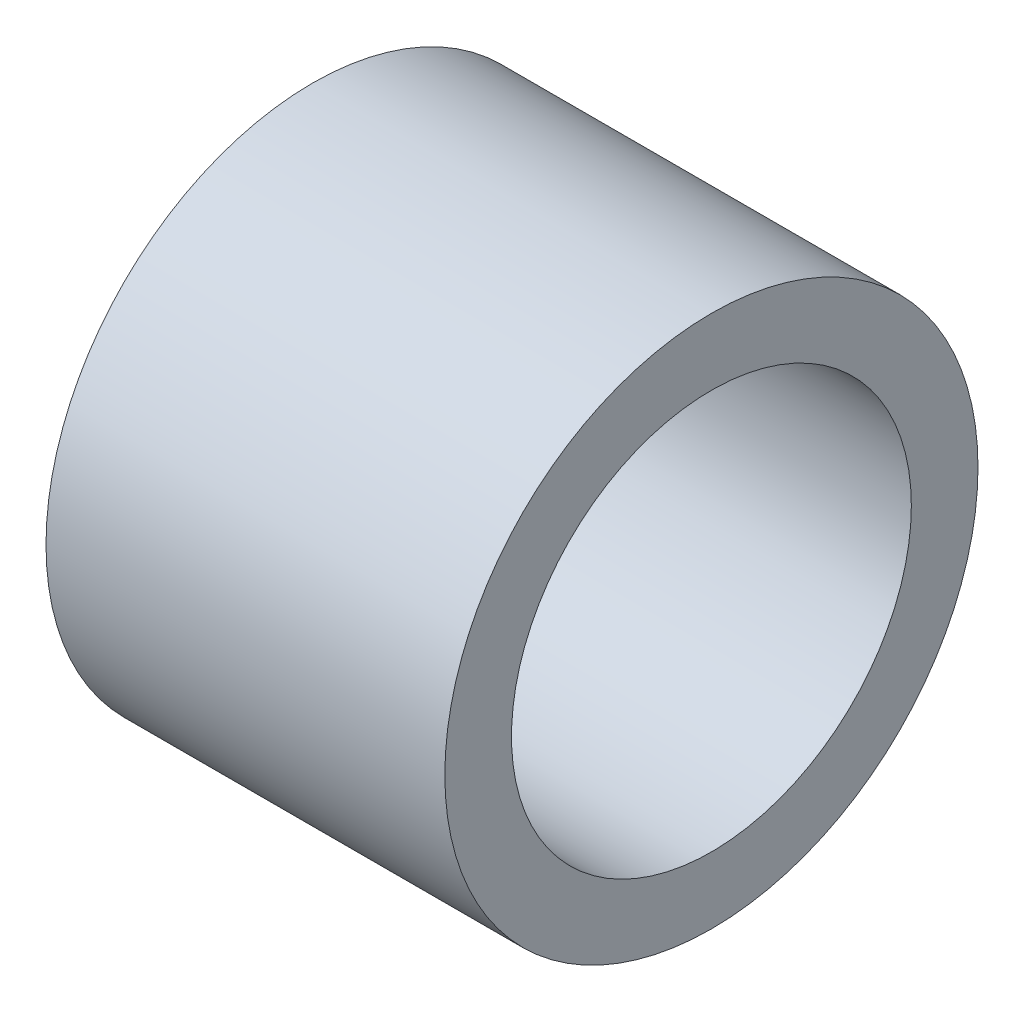
ISO-10303-21;
HEADER;
FILE_DESCRIPTION(('STEP AP214'),'2;1');
FILE_NAME('part.step','',(''),(''),'','','');
FILE_SCHEMA(('AUTOMOTIVE_DESIGN { 1 0 10303 214 1 1 1 1 }'));
ENDSEC;
DATA;
#1=APPLICATION_CONTEXT('core data for automotive mechanical design processes');
#2=APPLICATION_PROTOCOL_DEFINITION('international standard','automotive_design',2000,#1);
#3=PRODUCT_CONTEXT('',#1,'mechanical');
#4=PRODUCT('Part','Part','',(#3));
#5=PRODUCT_RELATED_PRODUCT_CATEGORY('part','',(#4));
#6=PRODUCT_DEFINITION_FORMATION('','',#4);
#7=PRODUCT_DEFINITION_CONTEXT('part definition',#1,'design');
#8=PRODUCT_DEFINITION('design','',#6,#7);
#9=PRODUCT_DEFINITION_SHAPE('','',#8);
#10=(LENGTH_UNIT() NAMED_UNIT(*) SI_UNIT(.MILLI.,.METRE.));
#11=(NAMED_UNIT(*) PLANE_ANGLE_UNIT() SI_UNIT($,.RADIAN.));
#12=(NAMED_UNIT(*) SI_UNIT($,.STERADIAN.) SOLID_ANGLE_UNIT());
#13=UNCERTAINTY_MEASURE_WITH_UNIT(LENGTH_MEASURE(1.E-05),#10,'distance_accuracy_value','');
#14=(GEOMETRIC_REPRESENTATION_CONTEXT(3) GLOBAL_UNCERTAINTY_ASSIGNED_CONTEXT((#13)) GLOBAL_UNIT_ASSIGNED_CONTEXT((#10,
#11,#12)) REPRESENTATION_CONTEXT('',''));
#15=CARTESIAN_POINT('',(0.,0.,0.));
#16=DIRECTION('',(0.,0.,1.));
#17=DIRECTION('',(1.,0.,0.));
#18=AXIS2_PLACEMENT_3D('',#15,#16,#17);
#19=CARTESIAN_POINT('',(9.5,0.,0.));
#20=DIRECTION('',(1.,0.,0.));
#21=DIRECTION('',(0.,0.,-1.));
#22=AXIS2_PLACEMENT_3D('',#19,#20,#21);
#23=PLANE('',#22);
#24=CARTESIAN_POINT('',(9.5,0.,0.));
#25=DIRECTION('',(1.,0.,0.));
#26=DIRECTION('',(0.,0.,-1.));
#27=AXIS2_PLACEMENT_3D('',#24,#25,#26);
#28=CIRCLE('',#27,12.7);
#29=CARTESIAN_POINT('',(9.5,0.,-12.7));
#30=VERTEX_POINT('',#29);
#31=EDGE_CURVE('E10',#30,#30,#28,.T.);
#32=ORIENTED_EDGE('',*,*,#31,.T.);
#33=EDGE_LOOP('',(#32));
#34=FACE_BOUND('',#33,.T.);
#35=CARTESIAN_POINT('',(9.5,0.,0.));
#36=DIRECTION('',(1.,0.,0.));
#37=DIRECTION('',(0.,0.,-1.));
#38=AXIS2_PLACEMENT_3D('',#35,#36,#37);
#39=CIRCLE('',#38,9.525);
#40=CARTESIAN_POINT('',(9.5,0.,-9.525));
#41=VERTEX_POINT('',#40);
#42=EDGE_CURVE('E54',#41,#41,#39,.T.);
#43=ORIENTED_EDGE('',*,*,#42,.F.);
#44=EDGE_LOOP('',(#43));
#45=FACE_BOUND('',#44,.T.);
#46=ADVANCED_FACE('F41',(#34,#45),#23,.T.);
#47=CARTESIAN_POINT('',(-9.5,0.,0.));
#48=DIRECTION('',(1.,0.,0.));
#49=DIRECTION('',(0.,0.,-1.));
#50=AXIS2_PLACEMENT_3D('',#47,#48,#49);
#51=PLANE('',#50);
#52=CARTESIAN_POINT('',(-9.5,0.,0.));
#53=DIRECTION('',(1.,0.,0.));
#54=DIRECTION('',(0.,0.,-1.));
#55=AXIS2_PLACEMENT_3D('',#52,#53,#54);
#56=CIRCLE('',#55,12.7);
#57=CARTESIAN_POINT('',(-9.5,0.,-12.7));
#58=VERTEX_POINT('',#57);
#59=EDGE_CURVE('E45',#58,#58,#56,.T.);
#60=ORIENTED_EDGE('',*,*,#59,.F.);
#61=EDGE_LOOP('',(#60));
#62=FACE_BOUND('',#61,.T.);
#63=CARTESIAN_POINT('',(-9.5,0.,0.));
#64=DIRECTION('',(1.,0.,0.));
#65=DIRECTION('',(0.,0.,-1.));
#66=AXIS2_PLACEMENT_3D('',#63,#64,#65);
#67=CIRCLE('',#66,9.525);
#68=CARTESIAN_POINT('',(-9.5,0.,-9.525));
#69=VERTEX_POINT('',#68);
#70=EDGE_CURVE('E56',#69,#69,#67,.T.);
#71=ORIENTED_EDGE('',*,*,#70,.T.);
#72=EDGE_LOOP('',(#71));
#73=FACE_BOUND('',#72,.T.);
#74=ADVANCED_FACE('F68',(#62,#73),#51,.F.);
#75=CARTESIAN_POINT('',(9.5,0.,0.));
#76=DIRECTION('',(-1.,0.,0.));
#77=DIRECTION('',(0.,0.,1.));
#78=AXIS2_PLACEMENT_3D('',#75,#76,#77);
#79=CYLINDRICAL_SURFACE('',#78,12.7);
#80=ORIENTED_EDGE('',*,*,#31,.F.);
#81=EDGE_LOOP('',(#80));
#82=FACE_BOUND('',#81,.T.);
#83=ORIENTED_EDGE('',*,*,#59,.T.);
#84=EDGE_LOOP('',(#83));
#85=FACE_BOUND('',#84,.T.);
#86=ADVANCED_FACE('F43',(#82,#85),#79,.T.);
#87=CARTESIAN_POINT('',(9.5,0.,0.));
#88=DIRECTION('',(-1.,0.,0.));
#89=DIRECTION('',(0.,0.,1.));
#90=AXIS2_PLACEMENT_3D('',#87,#88,#89);
#91=CYLINDRICAL_SURFACE('',#90,9.525);
#92=ORIENTED_EDGE('',*,*,#42,.T.);
#93=EDGE_LOOP('',(#92));
#94=FACE_BOUND('',#93,.T.);
#95=ORIENTED_EDGE('',*,*,#70,.F.);
#96=EDGE_LOOP('',(#95));
#97=FACE_BOUND('',#96,.T.);
#98=ADVANCED_FACE('F64',(#94,#97),#91,.F.);
#99=CLOSED_SHELL('',(#46,#74,#86,#98));
#100=MANIFOLD_SOLID_BREP('B2',#99);
#101=ADVANCED_BREP_SHAPE_REPRESENTATION('',(#18,#100),#14);
#102=SHAPE_DEFINITION_REPRESENTATION(#9,#101);
ENDSEC;
END-ISO-10303-21;
